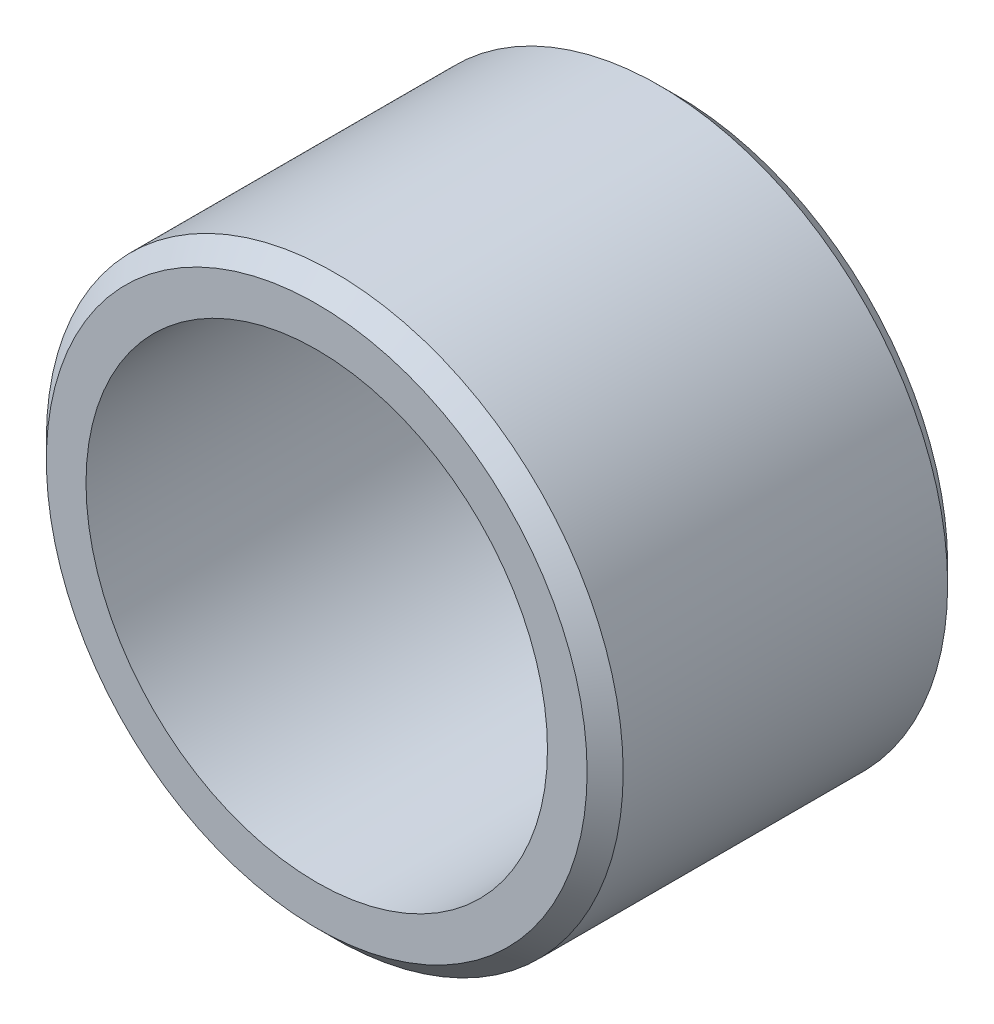
ISO-10303-21;
HEADER;
FILE_DESCRIPTION(('STEP AP214'),'2;1');
FILE_NAME('part.step','',(''),(''),'','','');
FILE_SCHEMA(('AUTOMOTIVE_DESIGN { 1 0 10303 214 1 1 1 1 }'));
ENDSEC;
DATA;
#1=APPLICATION_CONTEXT('core data for automotive mechanical design processes');
#2=APPLICATION_PROTOCOL_DEFINITION('international standard','automotive_design',2000,#1);
#3=PRODUCT_CONTEXT('',#1,'mechanical');
#4=PRODUCT('Part','Part','',(#3));
#5=PRODUCT_RELATED_PRODUCT_CATEGORY('part','',(#4));
#6=PRODUCT_DEFINITION_FORMATION('','',#4);
#7=PRODUCT_DEFINITION_CONTEXT('part definition',#1,'design');
#8=PRODUCT_DEFINITION('design','',#6,#7);
#9=PRODUCT_DEFINITION_SHAPE('','',#8);
#10=(LENGTH_UNIT() NAMED_UNIT(*) SI_UNIT(.MILLI.,.METRE.));
#11=(NAMED_UNIT(*) PLANE_ANGLE_UNIT() SI_UNIT($,.RADIAN.));
#12=(NAMED_UNIT(*) SI_UNIT($,.STERADIAN.) SOLID_ANGLE_UNIT());
#13=UNCERTAINTY_MEASURE_WITH_UNIT(LENGTH_MEASURE(1.E-05),#10,'distance_accuracy_value','');
#14=(GEOMETRIC_REPRESENTATION_CONTEXT(3) GLOBAL_UNCERTAINTY_ASSIGNED_CONTEXT((#13)) GLOBAL_UNIT_ASSIGNED_CONTEXT((#10,
#11,#12)) REPRESENTATION_CONTEXT('',''));
#15=CARTESIAN_POINT('',(0.,0.,0.));
#16=DIRECTION('',(0.,0.,1.));
#17=DIRECTION('',(1.,0.,0.));
#18=AXIS2_PLACEMENT_3D('',#15,#16,#17);
#19=CARTESIAN_POINT('',(0.,0.,5.));
#20=DIRECTION('',(0.,0.,1.));
#21=DIRECTION('',(1.,0.,0.));
#22=AXIS2_PLACEMENT_3D('',#19,#20,#21);
#23=PLANE('',#22);
#24=CARTESIAN_POINT('',(0.,0.,5.));
#25=DIRECTION('',(0.,0.,1.));
#26=DIRECTION('',(1.,0.,0.));
#27=AXIS2_PLACEMENT_3D('',#24,#25,#26);
#28=CIRCLE('',#27,3.75);
#29=CARTESIAN_POINT('',(3.75,0.,5.));
#30=VERTEX_POINT('',#29);
#31=EDGE_CURVE('E10',#30,#30,#28,.T.);
#32=ORIENTED_EDGE('',*,*,#31,.T.);
#33=EDGE_LOOP('',(#32));
#34=FACE_BOUND('',#33,.T.);
#35=CARTESIAN_POINT('',(0.,0.,5.));
#36=DIRECTION('',(0.,0.,1.));
#37=DIRECTION('',(1.,0.,0.));
#38=AXIS2_PLACEMENT_3D('',#35,#36,#37);
#39=CIRCLE('',#38,3.2);
#40=CARTESIAN_POINT('',(3.2,0.,5.));
#41=VERTEX_POINT('',#40);
#42=EDGE_CURVE('E70',#41,#41,#39,.T.);
#43=ORIENTED_EDGE('',*,*,#42,.F.);
#44=EDGE_LOOP('',(#43));
#45=FACE_BOUND('',#44,.T.);
#46=ADVANCED_FACE('F45',(#34,#45),#23,.T.);
#47=CARTESIAN_POINT('',(0.,0.,0.));
#48=DIRECTION('',(0.,0.,1.));
#49=DIRECTION('',(1.,0.,0.));
#50=AXIS2_PLACEMENT_3D('',#47,#48,#49);
#51=PLANE('',#50);
#52=CARTESIAN_POINT('',(0.,0.,0.));
#53=DIRECTION('',(0.,0.,1.));
#54=DIRECTION('',(1.,0.,0.));
#55=AXIS2_PLACEMENT_3D('',#52,#53,#54);
#56=CIRCLE('',#55,3.75);
#57=CARTESIAN_POINT('',(3.75,0.,0.));
#58=VERTEX_POINT('',#57);
#59=EDGE_CURVE('E54',#58,#58,#56,.F.);
#60=ORIENTED_EDGE('',*,*,#59,.T.);
#61=EDGE_LOOP('',(#60));
#62=FACE_BOUND('',#61,.T.);
#63=CARTESIAN_POINT('',(0.,0.,0.));
#64=DIRECTION('',(0.,0.,1.));
#65=DIRECTION('',(1.,0.,0.));
#66=AXIS2_PLACEMENT_3D('',#63,#64,#65);
#67=CIRCLE('',#66,3.2);
#68=CARTESIAN_POINT('',(3.2,0.,0.));
#69=VERTEX_POINT('',#68);
#70=EDGE_CURVE('E71',#69,#69,#67,.T.);
#71=ORIENTED_EDGE('',*,*,#70,.T.);
#72=EDGE_LOOP('',(#71));
#73=FACE_BOUND('',#72,.T.);
#74=ADVANCED_FACE('F83',(#62,#73),#51,.F.);
#75=CARTESIAN_POINT('',(0.,0.,5.));
#76=DIRECTION('',(0.,0.,-1.));
#77=DIRECTION('',(-1.,0.,0.));
#78=AXIS2_PLACEMENT_3D('',#75,#76,#77);
#79=CYLINDRICAL_SURFACE('',#78,4.);
#80=CARTESIAN_POINT('',(0.,0.,0.25));
#81=DIRECTION('',(0.,0.,1.));
#82=DIRECTION('',(1.,0.,0.));
#83=AXIS2_PLACEMENT_3D('',#80,#81,#82);
#84=CIRCLE('',#83,4.);
#85=CARTESIAN_POINT('',(4.,0.,0.25));
#86=VERTEX_POINT('',#85);
#87=EDGE_CURVE('E59',#86,#86,#84,.T.);
#88=ORIENTED_EDGE('',*,*,#87,.T.);
#89=EDGE_LOOP('',(#88));
#90=FACE_BOUND('',#89,.T.);
#91=CARTESIAN_POINT('',(0.,0.,4.75));
#92=DIRECTION('',(0.,0.,1.));
#93=DIRECTION('',(1.,0.,0.));
#94=AXIS2_PLACEMENT_3D('',#91,#92,#93);
#95=CIRCLE('',#94,4.);
#96=CARTESIAN_POINT('',(4.,0.,4.75));
#97=VERTEX_POINT('',#96);
#98=EDGE_CURVE('E64',#97,#97,#95,.F.);
#99=ORIENTED_EDGE('',*,*,#98,.T.);
#100=EDGE_LOOP('',(#99));
#101=FACE_BOUND('',#100,.T.);
#102=ADVANCED_FACE('F89',(#90,#101),#79,.T.);
#103=CARTESIAN_POINT('',(0.,0.,5.));
#104=DIRECTION('',(0.,0.,-1.));
#105=DIRECTION('',(-1.,0.,0.));
#106=AXIS2_PLACEMENT_3D('',#103,#104,#105);
#107=CYLINDRICAL_SURFACE('',#106,3.2);
#108=ORIENTED_EDGE('',*,*,#42,.T.);
#109=EDGE_LOOP('',(#108));
#110=FACE_BOUND('',#109,.T.);
#111=ORIENTED_EDGE('',*,*,#70,.F.);
#112=EDGE_LOOP('',(#111));
#113=FACE_BOUND('',#112,.T.);
#114=ADVANCED_FACE('F79',(#110,#113),#107,.F.);
#115=CARTESIAN_POINT('',(0.,0.,0.25));
#116=DIRECTION('',(0.,0.,1.));
#117=DIRECTION('',(1.,0.,0.));
#118=AXIS2_PLACEMENT_3D('',#115,#116,#117);
#119=CONICAL_SURFACE('',#118,4.,0.785398163397448);
#120=ORIENTED_EDGE('',*,*,#59,.F.);
#121=EDGE_LOOP('',(#120));
#122=FACE_BOUND('',#121,.T.);
#123=ORIENTED_EDGE('',*,*,#87,.F.);
#124=EDGE_LOOP('',(#123));
#125=FACE_BOUND('',#124,.T.);
#126=ADVANCED_FACE('F96',(#122,#125),#119,.T.);
#127=CARTESIAN_POINT('',(0.,0.,5.));
#128=DIRECTION('',(0.,0.,-1.));
#129=DIRECTION('',(-1.,0.,0.));
#130=AXIS2_PLACEMENT_3D('',#127,#128,#129);
#131=CONICAL_SURFACE('',#130,3.75,0.78539816339745);
#132=ORIENTED_EDGE('',*,*,#98,.F.);
#133=EDGE_LOOP('',(#132));
#134=FACE_BOUND('',#133,.T.);
#135=ORIENTED_EDGE('',*,*,#31,.F.);
#136=EDGE_LOOP('',(#135));
#137=FACE_BOUND('',#136,.T.);
#138=ADVANCED_FACE('F48',(#134,#137),#131,.T.);
#139=CLOSED_SHELL('',(#46,#74,#102,#114,#126,#138));
#140=MANIFOLD_SOLID_BREP('B2',#139);
#141=ADVANCED_BREP_SHAPE_REPRESENTATION('',(#18,#140),#14);
#142=SHAPE_DEFINITION_REPRESENTATION(#9,#141);
ENDSEC;
END-ISO-10303-21;
